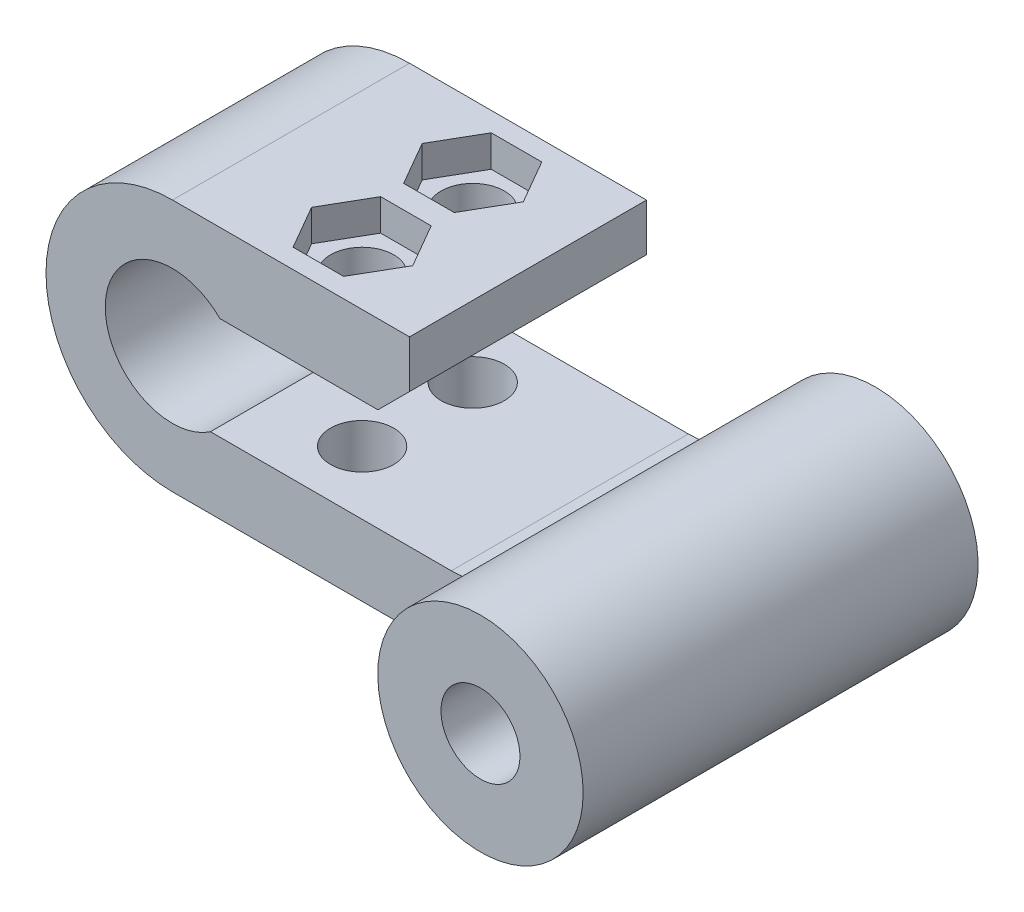
ISO-10303-21;
HEADER;
FILE_DESCRIPTION(('STEP AP214'),'2;1');
FILE_NAME('part.step','',(''),(''),'','','');
FILE_SCHEMA(('AUTOMOTIVE_DESIGN { 1 0 10303 214 1 1 1 1 }'));
ENDSEC;
DATA;
#1=APPLICATION_CONTEXT('core data for automotive mechanical design processes');
#2=APPLICATION_PROTOCOL_DEFINITION('international standard','automotive_design',2000,#1);
#3=PRODUCT_CONTEXT('',#1,'mechanical');
#4=PRODUCT('Part','Part','',(#3));
#5=PRODUCT_RELATED_PRODUCT_CATEGORY('part','',(#4));
#6=PRODUCT_DEFINITION_FORMATION('','',#4);
#7=PRODUCT_DEFINITION_CONTEXT('part definition',#1,'design');
#8=PRODUCT_DEFINITION('design','',#6,#7);
#9=PRODUCT_DEFINITION_SHAPE('','',#8);
#10=(LENGTH_UNIT() NAMED_UNIT(*) SI_UNIT(.MILLI.,.METRE.));
#11=(NAMED_UNIT(*) PLANE_ANGLE_UNIT() SI_UNIT($,.RADIAN.));
#12=(NAMED_UNIT(*) SI_UNIT($,.STERADIAN.) SOLID_ANGLE_UNIT());
#13=UNCERTAINTY_MEASURE_WITH_UNIT(LENGTH_MEASURE(1.E-05),#10,'distance_accuracy_value','');
#14=(GEOMETRIC_REPRESENTATION_CONTEXT(3) GLOBAL_UNCERTAINTY_ASSIGNED_CONTEXT((#13)) GLOBAL_UNIT_ASSIGNED_CONTEXT((#10,
#11,#12)) REPRESENTATION_CONTEXT('',''));
#15=CARTESIAN_POINT('',(0.,0.,0.));
#16=DIRECTION('',(0.,0.,1.));
#17=DIRECTION('',(1.,0.,0.));
#18=AXIS2_PLACEMENT_3D('',#15,#16,#17);
#19=CARTESIAN_POINT('',(6.17985722098058,-1.24574258897763,11.));
#20=DIRECTION('',(0.,1.,0.));
#21=DIRECTION('',(0.,0.,1.));
#22=AXIS2_PLACEMENT_3D('',#19,#20,#21);
#23=CYLINDRICAL_SURFACE('',#22,2.);
#24=CARTESIAN_POINT('',(6.17985722098058,9.75425064401288,11.));
#25=DIRECTION('',(0.,-1.,0.));
#26=DIRECTION('',(0.,0.,-1.));
#27=AXIS2_PLACEMENT_3D('',#24,#25,#26);
#28=CIRCLE('',#27,2.);
#29=CARTESIAN_POINT('',(6.17985722098058,9.75425064401288,9.));
#30=VERTEX_POINT('',#29);
#31=EDGE_CURVE('E299',#30,#30,#28,.T.);
#32=ORIENTED_EDGE('',*,*,#31,.T.);
#33=EDGE_LOOP('',(#32));
#34=FACE_BOUND('',#33,.T.);
#35=CARTESIAN_POINT('',(6.17985722098058,12.7542506440129,11.));
#36=DIRECTION('',(0.,1.,0.));
#37=DIRECTION('',(0.,0.,1.));
#38=AXIS2_PLACEMENT_3D('',#35,#36,#37);
#39=CIRCLE('',#38,2.);
#40=CARTESIAN_POINT('',(6.17985722098058,12.7542506440129,13.));
#41=VERTEX_POINT('',#40);
#42=EDGE_CURVE('E41',#41,#41,#39,.F.);
#43=ORIENTED_EDGE('',*,*,#42,.F.);
#44=EDGE_LOOP('',(#43));
#45=FACE_BOUND('',#44,.T.);
#46=ADVANCED_FACE('F36',(#34,#45),#23,.F.);
#47=CARTESIAN_POINT('',(6.17985722098058,-1.24574258897763,4.));
#48=DIRECTION('',(0.,1.,0.));
#49=DIRECTION('',(0.,0.,1.));
#50=AXIS2_PLACEMENT_3D('',#47,#48,#49);
#51=CYLINDRICAL_SURFACE('',#50,2.);
#52=CARTESIAN_POINT('',(6.17985722098058,9.75425064401288,4.));
#53=DIRECTION('',(0.,-1.,0.));
#54=DIRECTION('',(0.,0.,-1.));
#55=AXIS2_PLACEMENT_3D('',#52,#53,#54);
#56=CIRCLE('',#55,2.);
#57=CARTESIAN_POINT('',(6.17985722098058,9.75425064401288,2.));
#58=VERTEX_POINT('',#57);
#59=EDGE_CURVE('E308',#58,#58,#56,.T.);
#60=ORIENTED_EDGE('',*,*,#59,.T.);
#61=EDGE_LOOP('',(#60));
#62=FACE_BOUND('',#61,.T.);
#63=CARTESIAN_POINT('',(6.17985722098058,12.7542506440129,4.));
#64=DIRECTION('',(0.,1.,0.));
#65=DIRECTION('',(0.,0.,1.));
#66=AXIS2_PLACEMENT_3D('',#63,#64,#65);
#67=CIRCLE('',#66,2.);
#68=CARTESIAN_POINT('',(6.17985722098058,12.7542506440129,6.));
#69=VERTEX_POINT('',#68);
#70=EDGE_CURVE('E286',#69,#69,#67,.F.);
#71=ORIENTED_EDGE('',*,*,#70,.F.);
#72=EDGE_LOOP('',(#71));
#73=FACE_BOUND('',#72,.T.);
#74=ADVANCED_FACE('F409',(#62,#73),#51,.F.);
#75=CARTESIAN_POINT('',(0.,-1.24574258897763,15.));
#76=DIRECTION('',(0.,1.,0.));
#77=DIRECTION('',(-1.,0.,0.));
#78=AXIS2_PLACEMENT_3D('',#75,#76,#77);
#79=PLANE('',#78);
#80=CARTESIAN_POINT('',(6.17985722098058,-1.24574258897763,11.));
#81=DIRECTION('',(0.,1.,0.));
#82=DIRECTION('',(0.,0.,1.));
#83=AXIS2_PLACEMENT_3D('',#80,#81,#82);
#84=CIRCLE('',#83,2.);
#85=CARTESIAN_POINT('',(6.17985722098058,-1.24574258897763,13.));
#86=VERTEX_POINT('',#85);
#87=EDGE_CURVE('E296',#86,#86,#84,.T.);
#88=ORIENTED_EDGE('',*,*,#87,.T.);
#89=EDGE_LOOP('',(#88));
#90=FACE_BOUND('',#89,.T.);
#91=CARTESIAN_POINT('',(6.17985722098058,-1.24574258897763,4.));
#92=DIRECTION('',(0.,1.,0.));
#93=DIRECTION('',(0.,0.,1.));
#94=AXIS2_PLACEMENT_3D('',#91,#92,#93);
#95=CIRCLE('',#94,2.);
#96=CARTESIAN_POINT('',(6.17985722098058,-1.24574258897763,6.));
#97=VERTEX_POINT('',#96);
#98=EDGE_CURVE('E305',#97,#97,#95,.T.);
#99=ORIENTED_EDGE('',*,*,#98,.T.);
#100=EDGE_LOOP('',(#99));
#101=FACE_BOUND('',#100,.T.);
#102=DIRECTION('',(1.,0.,0.));
#103=VECTOR('',#102,1.);
#104=CARTESIAN_POINT('',(0.,-1.24574258897763,15.));
#105=LINE('',#104,#103);
#106=CARTESIAN_POINT('',(-1.83054816733695,-1.24574258897763,15.));
#107=VERTEX_POINT('',#106);
#108=CARTESIAN_POINT('',(20.7412486023875,-1.24574258897763,15.));
#109=VERTEX_POINT('',#108);
#110=EDGE_CURVE('E330',#107,#109,#105,.T.);
#111=ORIENTED_EDGE('',*,*,#110,.F.);
#112=DIRECTION('',(0.,0.,-1.));
#113=VECTOR('',#112,1.);
#114=CARTESIAN_POINT('',(-1.83054816733695,-1.24574258897763,15.));
#115=LINE('',#114,#113);
#116=CARTESIAN_POINT('',(-1.83054816733695,-1.24574258897763,0.));
#117=VERTEX_POINT('',#116);
#118=EDGE_CURVE('E369',#107,#117,#115,.T.);
#119=ORIENTED_EDGE('',*,*,#118,.T.);
#120=DIRECTION('',(1.,0.,0.));
#121=VECTOR('',#120,1.);
#122=CARTESIAN_POINT('',(0.,-1.24574258897763,0.));
#123=LINE('',#122,#121);
#124=CARTESIAN_POINT('',(27.6694518326631,-1.24574258897763,0.));
#125=VERTEX_POINT('',#124);
#126=EDGE_CURVE('E342',#117,#125,#123,.T.);
#127=ORIENTED_EDGE('',*,*,#126,.T.);
#128=DIRECTION('',(0.,0.,-1.));
#129=VECTOR('',#128,1.);
#130=CARTESIAN_POINT('',(27.6694518326631,-1.24574258897763,15.));
#131=LINE('',#130,#129);
#132=CARTESIAN_POINT('',(27.6694518326631,-1.24574258897763,18.));
#133=VERTEX_POINT('',#132);
#134=EDGE_CURVE('E383',#133,#125,#131,.T.);
#135=ORIENTED_EDGE('',*,*,#134,.F.);
#136=CARTESIAN_POINT('',(20.7412486023875,-1.24574258897763,15.));
#137=CARTESIAN_POINT('',(20.92770734225,-1.24574258897763,15.0000166059402));
#138=CARTESIAN_POINT('',(21.1139757104419,-1.24574258897763,15.0092390802562));
#139=CARTESIAN_POINT('',(21.4846324503399,-1.24574258897763,15.0440561219483));
#140=CARTESIAN_POINT('',(21.6690238103661,-1.24574258897763,15.0696182913552));
#141=CARTESIAN_POINT('',(22.0319788339475,-1.24574258897763,15.1345198161615));
#142=CARTESIAN_POINT('',(22.2105880436542,-1.24574258897763,15.173610987468));
#143=CARTESIAN_POINT('',(22.5647642054985,-1.24574258897763,15.2639248312056));
#144=CARTESIAN_POINT('',(22.7403296003568,-1.24574258897763,15.3151535276902));
#145=CARTESIAN_POINT('',(23.3424029276571,-1.24574258897763,15.5107529568727));
#146=CARTESIAN_POINT('',(23.7603133801105,-1.24574258897763,15.6817526098948));
#147=CARTESIAN_POINT('',(24.5757810278923,-1.24574258897763,16.0668290365426));
#148=CARTESIAN_POINT('',(24.9732945738818,-1.24574258897763,16.2809937239182));
#149=CARTESIAN_POINT('',(25.756250870451,-1.24574258897763,16.7379157384262));
#150=CARTESIAN_POINT('',(26.1415436898435,-1.24574258897763,16.9809245955478));
#151=CARTESIAN_POINT('',(26.9032756330931,-1.24574258897764,17.4795861286582));
#152=CARTESIAN_POINT('',(27.279720222547,-1.24574258897766,17.7352306796002));
#153=CARTESIAN_POINT('',(27.6605600203384,-1.24574258897763,17.9939592045208));
#154=CARTESIAN_POINT('',(27.6650059265361,-1.24574258897763,17.9969796030401));
#155=CARTESIAN_POINT('',(27.6694518326631,-1.24574258897763,18.));
#156=B_SPLINE_CURVE_WITH_KNOTS('',3,(#136,#137,#138,#139,#140,#141,#142,#143,#144,#145,#146,
#147,#148,#149,#150,#151,#152,#153,#154,#155),.UNSPECIFIED.,.F.,.F.,(4,2,2,2,2,2,2,2,2,4),(0.,
0.558875296934062,1.11664589172157,1.66468382868809,2.21299433780129,3.56338228703728,
4.91654886561008,6.28252795583859,7.64763983552954,7.66376435102622),.UNSPECIFIED.);
#157=EDGE_CURVE('E46',#133,#109,#156,.F.);
#158=ORIENTED_EDGE('',*,*,#157,.T.);
#159=EDGE_LOOP('',(#111,#119,#127,#135,#158));
#160=FACE_BOUND('',#159,.T.);
#161=ADVANCED_FACE('F403',(#90,#101,#160),#79,.F.);
#162=CARTESIAN_POINT('',(0.,3.25425064401287,15.));
#163=DIRECTION('',(0.,-1.,0.));
#164=DIRECTION('',(1.,0.,0.));
#165=AXIS2_PLACEMENT_3D('',#162,#163,#164);
#166=PLANE('',#165);
#167=CARTESIAN_POINT('',(6.17985722098058,3.25425064401288,11.));
#168=DIRECTION('',(0.,-1.,0.));
#169=DIRECTION('',(1.,0.,0.));
#170=AXIS2_PLACEMENT_3D('',#167,#168,#169);
#171=CIRCLE('',#170,2.);
#172=CARTESIAN_POINT('',(8.17985722098059,3.25425064401288,11.));
#173=VERTEX_POINT('',#172);
#174=EDGE_CURVE('E302',#173,#173,#171,.T.);
#175=ORIENTED_EDGE('',*,*,#174,.T.);
#176=EDGE_LOOP('',(#175));
#177=FACE_BOUND('',#176,.T.);
#178=CARTESIAN_POINT('',(6.17985722098058,3.25425064401288,4.));
#179=DIRECTION('',(0.,-1.,0.));
#180=DIRECTION('',(1.,0.,0.));
#181=AXIS2_PLACEMENT_3D('',#178,#179,#180);
#182=CIRCLE('',#181,2.);
#183=CARTESIAN_POINT('',(8.17985722098059,3.25425064401288,4.));
#184=VERTEX_POINT('',#183);
#185=EDGE_CURVE('E311',#184,#184,#182,.T.);
#186=ORIENTED_EDGE('',*,*,#185,.T.);
#187=EDGE_LOOP('',(#186));
#188=FACE_BOUND('',#187,.T.);
#189=DIRECTION('',(-1.,0.,0.));
#190=VECTOR('',#189,1.);
#191=CARTESIAN_POINT('',(0.,3.25425064401287,15.));
#192=LINE('',#191,#190);
#193=CARTESIAN_POINT('',(15.8267302647113,3.25425064401288,15.));
#194=VERTEX_POINT('',#193);
#195=CARTESIAN_POINT('',(0.580354698995034,3.25425064401287,15.));
#196=VERTEX_POINT('',#195);
#197=EDGE_CURVE('E316',#194,#196,#192,.T.);
#198=ORIENTED_EDGE('',*,*,#197,.F.);
#199=DIRECTION('',(0.,0.,1.));
#200=VECTOR('',#199,1.);
#201=CARTESIAN_POINT('',(15.8267302647113,3.25425064401288,0.));
#202=LINE('',#201,#200);
#203=CARTESIAN_POINT('',(15.8267302647113,3.25425064401288,0.));
#204=VERTEX_POINT('',#203);
#205=EDGE_CURVE('E385',#194,#204,#202,.F.);
#206=ORIENTED_EDGE('',*,*,#205,.T.);
#207=DIRECTION('',(-1.,0.,0.));
#208=VECTOR('',#207,1.);
#209=CARTESIAN_POINT('',(0.,3.25425064401287,0.));
#210=LINE('',#209,#208);
#211=CARTESIAN_POINT('',(0.580354698995032,3.25425064401287,0.));
#212=VERTEX_POINT('',#211);
#213=EDGE_CURVE('E348',#204,#212,#210,.T.);
#214=ORIENTED_EDGE('',*,*,#213,.T.);
#215=DIRECTION('',(0.,0.,-1.));
#216=VECTOR('',#215,1.);
#217=CARTESIAN_POINT('',(0.580354698995032,3.25425064401287,15.));
#218=LINE('',#217,#216);
#219=EDGE_CURVE('E381',#196,#212,#218,.T.);
#220=ORIENTED_EDGE('',*,*,#219,.F.);
#221=EDGE_LOOP('',(#198,#206,#214,#220));
#222=FACE_BOUND('',#221,.T.);
#223=ADVANCED_FACE('F408',(#177,#188,#222),#166,.F.);
#224=CARTESIAN_POINT('',(-1.83054816733695,6.75425741102237,15.));
#225=DIRECTION('',(0.,0.,-1.));
#226=DIRECTION('',(-1.,0.,0.));
#227=AXIS2_PLACEMENT_3D('',#224,#225,#226);
#228=CYLINDRICAL_SURFACE('',#227,4.25);
#229=DIRECTION('',(0.,0.,-1.));
#230=VECTOR('',#229,1.);
#231=CARTESIAN_POINT('',(1.17985722098058,9.75425064401288,15.));
#232=LINE('',#231,#230);
#233=CARTESIAN_POINT('',(1.17985722098058,9.75425064401288,15.));
#234=VERTEX_POINT('',#233);
#235=CARTESIAN_POINT('',(1.17985722098058,9.75425064401288,0.));
#236=VERTEX_POINT('',#235);
#237=EDGE_CURVE('E379',#234,#236,#232,.T.);
#238=ORIENTED_EDGE('',*,*,#237,.F.);
#239=CARTESIAN_POINT('',(-1.83054816733695,6.75425741102237,15.));
#240=DIRECTION('',(0.,0.,1.));
#241=DIRECTION('',(1.,0.,0.));
#242=AXIS2_PLACEMENT_3D('',#239,#240,#241);
#243=CIRCLE('',#242,4.25);
#244=EDGE_CURVE('E318',#196,#234,#243,.F.);
#245=ORIENTED_EDGE('',*,*,#244,.F.);
#246=ORIENTED_EDGE('',*,*,#219,.T.);
#247=CARTESIAN_POINT('',(-1.83054816733695,6.75425741102237,0.));
#248=DIRECTION('',(0.,0.,1.));
#249=DIRECTION('',(1.,0.,0.));
#250=AXIS2_PLACEMENT_3D('',#247,#248,#249);
#251=CIRCLE('',#250,4.25);
#252=EDGE_CURVE('E351',#236,#212,#251,.T.);
#253=ORIENTED_EDGE('',*,*,#252,.F.);
#254=EDGE_LOOP('',(#238,#245,#246,#253));
#255=FACE_BOUND('',#254,.T.);
#256=ADVANCED_FACE('F460',(#255),#228,.F.);
#257=CARTESIAN_POINT('',(0.,9.75425064401288,15.));
#258=DIRECTION('',(0.,-1.,0.));
#259=DIRECTION('',(0.,0.,-1.));
#260=AXIS2_PLACEMENT_3D('',#257,#258,#259);
#261=PLANE('',#260);
#262=ORIENTED_EDGE('',*,*,#31,.F.);
#263=EDGE_LOOP('',(#262));
#264=FACE_BOUND('',#263,.T.);
#265=ORIENTED_EDGE('',*,*,#59,.F.);
#266=EDGE_LOOP('',(#265));
#267=FACE_BOUND('',#266,.T.);
#268=DIRECTION('',(0.,0.,-1.));
#269=VECTOR('',#268,1.);
#270=CARTESIAN_POINT('',(11.1798572209806,9.75425064401288,15.));
#271=LINE('',#270,#269);
#272=CARTESIAN_POINT('',(11.1798572209806,9.75425064401288,15.));
#273=VERTEX_POINT('',#272);
#274=CARTESIAN_POINT('',(11.1798572209806,9.75425064401288,0.));
#275=VERTEX_POINT('',#274);
#276=EDGE_CURVE('E377',#273,#275,#271,.T.);
#277=ORIENTED_EDGE('',*,*,#276,.F.);
#278=DIRECTION('',(1.,0.,0.));
#279=VECTOR('',#278,1.);
#280=CARTESIAN_POINT('',(0.,9.75425064401288,15.));
#281=LINE('',#280,#279);
#282=EDGE_CURVE('E320',#234,#273,#281,.T.);
#283=ORIENTED_EDGE('',*,*,#282,.F.);
#284=ORIENTED_EDGE('',*,*,#237,.T.);
#285=DIRECTION('',(-1.,0.,0.));
#286=VECTOR('',#285,1.);
#287=CARTESIAN_POINT('',(0.,9.75425064401288,0.));
#288=LINE('',#287,#286);
#289=EDGE_CURVE('E354',#275,#236,#288,.T.);
#290=ORIENTED_EDGE('',*,*,#289,.F.);
#291=EDGE_LOOP('',(#277,#283,#284,#290));
#292=FACE_BOUND('',#291,.T.);
#293=ADVANCED_FACE('F484',(#264,#267,#292),#261,.T.);
#294=CARTESIAN_POINT('',(0.712803288483824,-0.712803288483827,15.));
#295=DIRECTION('',(0.707106781186546,-0.707106781186549,0.));
#296=DIRECTION('',(0.707106781186549,0.707106781186546,0.));
#297=AXIS2_PLACEMENT_3D('',#294,#295,#296);
#298=PLANE('',#297);
#299=DIRECTION('',(0.,0.,-1.));
#300=VECTOR('',#299,1.);
#301=CARTESIAN_POINT('',(13.1798572209806,11.7542506440129,15.));
#302=LINE('',#301,#300);
#303=CARTESIAN_POINT('',(13.1798572209806,11.7542506440129,15.));
#304=VERTEX_POINT('',#303);
#305=CARTESIAN_POINT('',(13.1798572209806,11.7542506440129,0.));
#306=VERTEX_POINT('',#305);
#307=EDGE_CURVE('E375',#304,#306,#302,.T.);
#308=ORIENTED_EDGE('',*,*,#307,.F.);
#309=DIRECTION('',(0.707106781186549,0.707106781186546,0.));
#310=VECTOR('',#309,1.);
#311=CARTESIAN_POINT('',(0.712803288483824,-0.712803288483827,15.));
#312=LINE('',#311,#310);
#313=EDGE_CURVE('E322',#273,#304,#312,.T.);
#314=ORIENTED_EDGE('',*,*,#313,.F.);
#315=ORIENTED_EDGE('',*,*,#276,.T.);
#316=DIRECTION('',(-0.707106781186549,-0.707106781186546,0.));
#317=VECTOR('',#316,1.);
#318=CARTESIAN_POINT('',(0.712803288483824,-0.712803288483827,0.));
#319=LINE('',#318,#317);
#320=EDGE_CURVE('E357',#306,#275,#319,.T.);
#321=ORIENTED_EDGE('',*,*,#320,.F.);
#322=EDGE_LOOP('',(#308,#314,#315,#321));
#323=FACE_BOUND('',#322,.T.);
#324=ADVANCED_FACE('F488',(#323),#298,.T.);
#325=CARTESIAN_POINT('',(13.1798572209806,0.,15.));
#326=DIRECTION('',(1.,0.,0.));
#327=DIRECTION('',(0.,0.,-1.));
#328=AXIS2_PLACEMENT_3D('',#325,#326,#327);
#329=PLANE('',#328);
#330=DIRECTION('',(0.,0.,-1.));
#331=VECTOR('',#330,1.);
#332=CARTESIAN_POINT('',(13.1798572209806,14.7542506440129,15.));
#333=LINE('',#332,#331);
#334=CARTESIAN_POINT('',(13.1798572209806,14.7542506440129,15.));
#335=VERTEX_POINT('',#334);
#336=CARTESIAN_POINT('',(13.1798572209806,14.7542506440129,0.));
#337=VERTEX_POINT('',#336);
#338=EDGE_CURVE('E373',#335,#337,#333,.T.);
#339=ORIENTED_EDGE('',*,*,#338,.F.);
#340=DIRECTION('',(0.,1.,0.));
#341=VECTOR('',#340,1.);
#342=CARTESIAN_POINT('',(13.1798572209806,0.,15.));
#343=LINE('',#342,#341);
#344=EDGE_CURVE('E324',#304,#335,#343,.T.);
#345=ORIENTED_EDGE('',*,*,#344,.F.);
#346=ORIENTED_EDGE('',*,*,#307,.T.);
#347=DIRECTION('',(0.,-1.,0.));
#348=VECTOR('',#347,1.);
#349=CARTESIAN_POINT('',(13.1798572209806,0.,0.));
#350=LINE('',#349,#348);
#351=EDGE_CURVE('E360',#337,#306,#350,.T.);
#352=ORIENTED_EDGE('',*,*,#351,.F.);
#353=EDGE_LOOP('',(#339,#345,#346,#352));
#354=FACE_BOUND('',#353,.T.);
#355=ADVANCED_FACE('F493',(#354),#329,.T.);
#356=CARTESIAN_POINT('',(0.,14.7542506440129,15.));
#357=DIRECTION('',(0.,1.,0.));
#358=DIRECTION('',(0.,0.,1.));
#359=AXIS2_PLACEMENT_3D('',#356,#357,#358);
#360=PLANE('',#359);
#361=DIRECTION('',(0.5,0.,-0.866025403784439));
#362=VECTOR('',#361,1.);
#363=CARTESIAN_POINT('',(7.77985722098058,14.7542506440129,13.7712812921102));
#364=LINE('',#363,#362);
#365=CARTESIAN_POINT('',(7.77985722098058,14.7542506440129,13.7712812921102));
#366=VERTEX_POINT('',#365);
#367=CARTESIAN_POINT('',(9.37985722098058,14.7542506440129,11.));
#368=VERTEX_POINT('',#367);
#369=EDGE_CURVE('E54',#366,#368,#364,.T.);
#370=ORIENTED_EDGE('',*,*,#369,.F.);
#371=DIRECTION('',(1.,0.,0.));
#372=VECTOR('',#371,1.);
#373=CARTESIAN_POINT('',(4.57985722098059,14.7542506440129,13.7712812921102));
#374=LINE('',#373,#372);
#375=CARTESIAN_POINT('',(4.57985722098059,14.7542506440129,13.7712812921102));
#376=VERTEX_POINT('',#375);
#377=EDGE_CURVE('E216',#376,#366,#374,.T.);
#378=ORIENTED_EDGE('',*,*,#377,.F.);
#379=DIRECTION('',(0.5,0.,0.866025403784439));
#380=VECTOR('',#379,1.);
#381=CARTESIAN_POINT('',(2.97985722098059,14.7542506440129,11.));
#382=LINE('',#381,#380);
#383=CARTESIAN_POINT('',(2.97985722098059,14.7542506440129,11.));
#384=VERTEX_POINT('',#383);
#385=EDGE_CURVE('E219',#384,#376,#382,.T.);
#386=ORIENTED_EDGE('',*,*,#385,.F.);
#387=DIRECTION('',(-0.5,0.,0.866025403784439));
#388=VECTOR('',#387,1.);
#389=CARTESIAN_POINT('',(4.57985722098058,14.7542506440129,8.2287187078898));
#390=LINE('',#389,#388);
#391=CARTESIAN_POINT('',(4.57985722098058,14.7542506440129,8.2287187078898));
#392=VERTEX_POINT('',#391);
#393=EDGE_CURVE('E235',#392,#384,#390,.T.);
#394=ORIENTED_EDGE('',*,*,#393,.F.);
#395=DIRECTION('',(-1.,0.,0.));
#396=VECTOR('',#395,1.);
#397=CARTESIAN_POINT('',(7.77985722098058,14.7542506440129,8.2287187078898));
#398=LINE('',#397,#396);
#399=CARTESIAN_POINT('',(7.77985722098058,14.7542506440129,8.2287187078898));
#400=VERTEX_POINT('',#399);
#401=EDGE_CURVE('E232',#400,#392,#398,.T.);
#402=ORIENTED_EDGE('',*,*,#401,.F.);
#403=DIRECTION('',(-0.5,0.,-0.866025403784439));
#404=VECTOR('',#403,1.);
#405=CARTESIAN_POINT('',(9.37985722098058,14.7542506440129,11.));
#406=LINE('',#405,#404);
#407=EDGE_CURVE('E230',#368,#400,#406,.T.);
#408=ORIENTED_EDGE('',*,*,#407,.F.);
#409=EDGE_LOOP('',(#370,#378,#386,#394,#402,#408));
#410=FACE_BOUND('',#409,.T.);
#411=DIRECTION('',(0.5,0.,-0.866025403784439));
#412=VECTOR('',#411,1.);
#413=CARTESIAN_POINT('',(7.77985722098058,14.7542506440129,6.77128129211021));
#414=LINE('',#413,#412);
#415=CARTESIAN_POINT('',(7.77985722098058,14.7542506440129,6.77128129211021));
#416=VERTEX_POINT('',#415);
#417=CARTESIAN_POINT('',(9.37985722098059,14.7542506440129,4.));
#418=VERTEX_POINT('',#417);
#419=EDGE_CURVE('E62',#416,#418,#414,.T.);
#420=ORIENTED_EDGE('',*,*,#419,.F.);
#421=DIRECTION('',(1.,0.,0.));
#422=VECTOR('',#421,1.);
#423=CARTESIAN_POINT('',(4.57985722098058,14.7542506440129,6.77128129211021));
#424=LINE('',#423,#422);
#425=CARTESIAN_POINT('',(4.57985722098058,14.7542506440129,6.77128129211021));
#426=VERTEX_POINT('',#425);
#427=EDGE_CURVE('E253',#426,#416,#424,.T.);
#428=ORIENTED_EDGE('',*,*,#427,.F.);
#429=DIRECTION('',(0.5,0.,0.866025403784439));
#430=VECTOR('',#429,1.);
#431=CARTESIAN_POINT('',(2.97985722098058,14.7542506440129,4.));
#432=LINE('',#431,#430);
#433=CARTESIAN_POINT('',(2.97985722098058,14.7542506440129,4.));
#434=VERTEX_POINT('',#433);
#435=EDGE_CURVE('E279',#434,#426,#432,.T.);
#436=ORIENTED_EDGE('',*,*,#435,.F.);
#437=DIRECTION('',(-0.5,0.,0.866025403784439));
#438=VECTOR('',#437,1.);
#439=CARTESIAN_POINT('',(4.57985722098058,14.7542506440129,1.22871870788979));
#440=LINE('',#439,#438);
#441=CARTESIAN_POINT('',(4.57985722098058,14.7542506440129,1.22871870788979));
#442=VERTEX_POINT('',#441);
#443=EDGE_CURVE('E276',#442,#434,#440,.T.);
#444=ORIENTED_EDGE('',*,*,#443,.F.);
#445=DIRECTION('',(-1.,0.,0.));
#446=VECTOR('',#445,1.);
#447=CARTESIAN_POINT('',(7.77985722098058,14.7542506440129,1.22871870788979));
#448=LINE('',#447,#446);
#449=CARTESIAN_POINT('',(7.77985722098058,14.7542506440129,1.22871870788979));
#450=VERTEX_POINT('',#449);
#451=EDGE_CURVE('E273',#450,#442,#448,.T.);
#452=ORIENTED_EDGE('',*,*,#451,.F.);
#453=DIRECTION('',(-0.5,0.,-0.866025403784439));
#454=VECTOR('',#453,1.);
#455=CARTESIAN_POINT('',(9.37985722098058,14.7542506440129,4.));
#456=LINE('',#455,#454);
#457=EDGE_CURVE('E270',#418,#450,#456,.T.);
#458=ORIENTED_EDGE('',*,*,#457,.F.);
#459=EDGE_LOOP('',(#420,#428,#436,#444,#452,#458));
#460=FACE_BOUND('',#459,.T.);
#461=DIRECTION('',(0.,0.,-1.));
#462=VECTOR('',#461,1.);
#463=CARTESIAN_POINT('',(-1.82014277901941,14.7542506440129,15.));
#464=LINE('',#463,#462);
#465=CARTESIAN_POINT('',(-1.82014277901941,14.7542506440129,15.));
#466=VERTEX_POINT('',#465);
#467=CARTESIAN_POINT('',(-1.82014277901941,14.7542506440129,0.));
#468=VERTEX_POINT('',#467);
#469=EDGE_CURVE('E371',#466,#468,#464,.T.);
#470=ORIENTED_EDGE('',*,*,#469,.F.);
#471=DIRECTION('',(-1.,0.,0.));
#472=VECTOR('',#471,1.);
#473=CARTESIAN_POINT('',(0.,14.7542506440129,15.));
#474=LINE('',#473,#472);
#475=EDGE_CURVE('E326',#335,#466,#474,.T.);
#476=ORIENTED_EDGE('',*,*,#475,.F.);
#477=ORIENTED_EDGE('',*,*,#338,.T.);
#478=DIRECTION('',(1.,0.,0.));
#479=VECTOR('',#478,1.);
#480=CARTESIAN_POINT('',(0.,14.7542506440129,0.));
#481=LINE('',#480,#479);
#482=EDGE_CURVE('E363',#468,#337,#481,.T.);
#483=ORIENTED_EDGE('',*,*,#482,.F.);
#484=EDGE_LOOP('',(#470,#476,#477,#483));
#485=FACE_BOUND('',#484,.T.);
#486=ADVANCED_FACE('F498',(#410,#460,#485),#360,.T.);
#487=CARTESIAN_POINT('',(-1.83054816733695,6.75425741102237,15.));
#488=DIRECTION('',(0.,0.,-1.));
#489=DIRECTION('',(-1.,0.,0.));
#490=AXIS2_PLACEMENT_3D('',#487,#488,#489);
#491=CYLINDRICAL_SURFACE('',#490,8.);
#492=CARTESIAN_POINT('',(-1.83054816733695,6.75425741102237,15.));
#493=DIRECTION('',(0.,0.,1.));
#494=DIRECTION('',(1.,0.,0.));
#495=AXIS2_PLACEMENT_3D('',#492,#493,#494);
#496=CIRCLE('',#495,8.);
#497=EDGE_CURVE('E328',#466,#107,#496,.T.);
#498=ORIENTED_EDGE('',*,*,#497,.F.);
#499=ORIENTED_EDGE('',*,*,#469,.T.);
#500=CARTESIAN_POINT('',(-1.83054816733695,6.75425741102237,0.));
#501=DIRECTION('',(0.,0.,1.));
#502=DIRECTION('',(1.,0.,0.));
#503=AXIS2_PLACEMENT_3D('',#500,#501,#502);
#504=CIRCLE('',#503,8.);
#505=EDGE_CURVE('E366',#468,#117,#504,.T.);
#506=ORIENTED_EDGE('',*,*,#505,.T.);
#507=ORIENTED_EDGE('',*,*,#118,.F.);
#508=EDGE_LOOP('',(#498,#499,#506,#507));
#509=FACE_BOUND('',#508,.T.);
#510=ADVANCED_FACE('F427',(#509),#491,.T.);
#511=CARTESIAN_POINT('',(0.,0.,25.));
#512=DIRECTION('',(0.,0.,1.));
#513=DIRECTION('',(1.,0.,0.));
#514=AXIS2_PLACEMENT_3D('',#511,#512,#513);
#515=PLANE('',#514);
#516=CARTESIAN_POINT('',(27.6694518326631,5.25425741102237,25.));
#517=DIRECTION('',(0.,0.,1.));
#518=DIRECTION('',(1.,0.,0.));
#519=AXIS2_PLACEMENT_3D('',#516,#517,#518);
#520=CIRCLE('',#519,2.5);
#521=CARTESIAN_POINT('',(30.1694518326631,5.25425741102237,25.));
#522=VERTEX_POINT('',#521);
#523=EDGE_CURVE('E333',#522,#522,#520,.T.);
#524=ORIENTED_EDGE('',*,*,#523,.F.);
#525=EDGE_LOOP('',(#524));
#526=FACE_BOUND('',#525,.T.);
#527=CARTESIAN_POINT('',(27.6694518326631,5.25425741102237,25.));
#528=DIRECTION('',(0.,0.,1.));
#529=DIRECTION('',(1.,0.,0.));
#530=AXIS2_PLACEMENT_3D('',#527,#528,#529);
#531=CIRCLE('',#530,6.5);
#532=CARTESIAN_POINT('',(34.1694518326631,5.25425741102237,25.));
#533=VERTEX_POINT('',#532);
#534=EDGE_CURVE('E336',#533,#533,#531,.T.);
#535=ORIENTED_EDGE('',*,*,#534,.T.);
#536=EDGE_LOOP('',(#535));
#537=FACE_BOUND('',#536,.T.);
#538=ADVANCED_FACE('F420',(#526,#537),#515,.T.);
#539=CARTESIAN_POINT('',(15.8267302647113,9.25425064401288,15.));
#540=DIRECTION('',(0.,0.,-1.));
#541=DIRECTION('',(-1.,0.,0.));
#542=AXIS2_PLACEMENT_3D('',#539,#540,#541);
#543=CYLINDRICAL_SURFACE('',#542,6.);
#544=CARTESIAN_POINT('',(15.8267302647113,9.25425064401288,15.));
#545=DIRECTION('',(0.,0.,1.));
#546=DIRECTION('',(1.,0.,0.));
#547=AXIS2_PLACEMENT_3D('',#544,#545,#546);
#548=CIRCLE('',#547,6.);
#549=CARTESIAN_POINT('',(18.2844297125939,3.78070394887293,15.));
#550=VERTEX_POINT('',#549);
#551=EDGE_CURVE('E314',#550,#194,#548,.F.);
#552=ORIENTED_EDGE('',*,*,#551,.F.);
#553=CARTESIAN_POINT('',(18.2844297125939,3.78070394887293,15.));
#554=CARTESIAN_POINT('',(18.3696640462424,3.81895291347259,14.9999790596979));
#555=CARTESIAN_POINT('',(18.4539450006303,3.85920954888873,15.0040601951146));
#556=CARTESIAN_POINT('',(18.6198516296836,3.94322071478237,15.0198860348313));
#557=CARTESIAN_POINT('',(18.7014811782602,3.98696978621143,15.0316189766923));
#558=CARTESIAN_POINT('',(18.8606250408765,4.07701586657384,15.06202444041));
#559=CARTESIAN_POINT('',(18.9381774091614,4.12327528224833,15.0806105594364));
#560=CARTESIAN_POINT('',(19.0898655723118,4.21838290859679,15.1241389668394));
#561=CARTESIAN_POINT('',(19.1639997718066,4.26723230568349,15.1490841884546));
#562=CARTESIAN_POINT('',(19.3280456495437,4.38052278684904,15.2121979812004));
#563=CARTESIAN_POINT('',(19.4168308815514,4.44562050960281,15.2521185201694));
#564=CARTESIAN_POINT('',(19.5882796658439,4.57851247930572,15.3399488272102));
#565=CARTESIAN_POINT('',(19.6709385408968,4.64630872699765,15.3878646104196));
#566=CARTESIAN_POINT('',(19.8305201424638,4.78425638155853,15.4907421843948));
#567=CARTESIAN_POINT('',(19.9074115800018,4.85441800716696,15.5457385485165));
#568=CARTESIAN_POINT('',(20.055170392264,4.9962255291615,15.6614850064614));
#569=CARTESIAN_POINT('',(20.1260391380326,5.06787108309285,15.7222337840746));
#570=CARTESIAN_POINT('',(20.3051104434588,5.25795795211078,15.8885018189479));
#571=CARTESIAN_POINT('',(20.4085871990115,5.37734542514132,15.998042859772));
#572=CARTESIAN_POINT('',(20.6019098624371,5.61810938558039,16.226585464675));
#573=CARTESIAN_POINT('',(20.6917455030756,5.73948729574204,16.3455940530167));
#574=CARTESIAN_POINT('',(20.8592326237194,5.98379878503921,16.5903926659417));
#575=CARTESIAN_POINT('',(20.9368811946217,6.10673272806119,16.716184300067));
#576=CARTESIAN_POINT('',(21.0812129994578,6.35409388273191,16.9723414847916));
#577=CARTESIAN_POINT('',(21.1479002793389,6.47852052512833,17.1027053260763));
#578=CARTESIAN_POINT('',(21.2680030466903,6.72245001129002,17.3591610081865));
#579=CARTESIAN_POINT('',(21.3219410435876,6.84185550092716,17.4851029224994));
#580=CARTESIAN_POINT('',(21.4214637712007,7.08263708478053,17.7380928868171));
#581=CARTESIAN_POINT('',(21.4670585439949,7.2040106160069,17.8651394116727));
#582=CARTESIAN_POINT('',(21.5095333042948,7.32921645522517,17.9947856484329));
#583=CARTESIAN_POINT('',(21.5103857970343,7.33173489577874,17.9973928285372));
#584=CARTESIAN_POINT('',(21.5112366173281,7.33425389217743,18.));
#585=B_SPLINE_CURVE_WITH_KNOTS('',3,(#553,#554,#555,#556,#557,#558,#559,#560,#561,#562,#563,
#564,#565,#566,#567,#568,#569,#570,#571,#572,#573,#574,#575,#576,#577,#578,#579,#580,#581,#582,
#583,#584),.UNSPECIFIED.,.F.,.F.,(4,2,2,2,2,2,2,2,2,2,2,2,2,2,2,4),(0.,0.280083485310526,
0.559737434910414,0.835979853112762,1.11234992387342,1.46313414593545,1.81418347664671,
2.16701700346691,2.51976999262055,3.09555801606276,3.67177729132909,4.24813390397213,
4.82427729622665,5.36928114223432,5.91362463236834,5.92479602566152),.UNSPECIFIED.);
#586=CARTESIAN_POINT('',(21.5112366173281,7.33425389217743,18.));
#587=VERTEX_POINT('',#586);
#588=EDGE_CURVE('E11',#550,#587,#585,.T.);
#589=ORIENTED_EDGE('',*,*,#588,.T.);
#590=DIRECTION('',(0.,0.,-1.));
#591=VECTOR('',#590,1.);
#592=CARTESIAN_POINT('',(21.5112366173281,7.33425389217743,15.));
#593=LINE('',#592,#591);
#594=CARTESIAN_POINT('',(21.5112366173281,7.33425389217743,0.));
#595=VERTEX_POINT('',#594);
#596=EDGE_CURVE('E387',#595,#587,#593,.F.);
#597=ORIENTED_EDGE('',*,*,#596,.F.);
#598=CARTESIAN_POINT('',(15.8267302647113,9.25425064401288,0.));
#599=DIRECTION('',(0.,0.,1.));
#600=DIRECTION('',(1.,0.,0.));
#601=AXIS2_PLACEMENT_3D('',#598,#599,#600);
#602=CIRCLE('',#601,6.);
#603=EDGE_CURVE('E389',#204,#595,#602,.T.);
#604=ORIENTED_EDGE('',*,*,#603,.F.);
#605=ORIENTED_EDGE('',*,*,#205,.F.);
#606=EDGE_LOOP('',(#552,#589,#597,#604,#605));
#607=FACE_BOUND('',#606,.T.);
#608=ADVANCED_FACE('F417',(#607),#543,.F.);
#609=CARTESIAN_POINT('',(27.6694518326631,5.25425741102237,15.));
#610=DIRECTION('',(0.,0.,-1.));
#611=DIRECTION('',(-1.,0.,0.));
#612=AXIS2_PLACEMENT_3D('',#609,#610,#611);
#613=CYLINDRICAL_SURFACE('',#612,6.5);
#614=CARTESIAN_POINT('',(27.6694518326631,5.25425741102237,18.));
#615=DIRECTION('',(0.,0.,1.));
#616=DIRECTION('',(1.,0.,0.));
#617=AXIS2_PLACEMENT_3D('',#614,#615,#616);
#618=CIRCLE('',#617,6.5);
#619=EDGE_CURVE('E391',#587,#133,#618,.T.);
#620=ORIENTED_EDGE('',*,*,#619,.T.);
#621=ORIENTED_EDGE('',*,*,#134,.T.);
#622=CARTESIAN_POINT('',(27.6694518326631,5.25425741102237,0.));
#623=DIRECTION('',(0.,0.,1.));
#624=DIRECTION('',(1.,0.,0.));
#625=AXIS2_PLACEMENT_3D('',#622,#623,#624);
#626=CIRCLE('',#625,6.5);
#627=EDGE_CURVE('E345',#125,#595,#626,.T.);
#628=ORIENTED_EDGE('',*,*,#627,.T.);
#629=ORIENTED_EDGE('',*,*,#596,.T.);
#630=EDGE_LOOP('',(#620,#621,#628,#629));
#631=FACE_BOUND('',#630,.T.);
#632=ORIENTED_EDGE('',*,*,#534,.F.);
#633=EDGE_LOOP('',(#632));
#634=FACE_BOUND('',#633,.T.);
#635=ADVANCED_FACE('F411',(#631,#634),#613,.T.);
#636=CARTESIAN_POINT('',(27.6694518326631,5.25425741102237,15.));
#637=DIRECTION('',(0.,0.,-1.));
#638=DIRECTION('',(-1.,0.,0.));
#639=AXIS2_PLACEMENT_3D('',#636,#637,#638);
#640=CYLINDRICAL_SURFACE('',#639,2.5);
#641=CARTESIAN_POINT('',(27.6694518326631,5.25425741102237,0.));
#642=DIRECTION('',(0.,0.,1.));
#643=DIRECTION('',(1.,0.,0.));
#644=AXIS2_PLACEMENT_3D('',#641,#642,#643);
#645=CIRCLE('',#644,2.5);
#646=CARTESIAN_POINT('',(30.1694518326631,5.25425741102237,0.));
#647=VERTEX_POINT('',#646);
#648=EDGE_CURVE('E339',#647,#647,#645,.T.);
#649=ORIENTED_EDGE('',*,*,#648,.F.);
#650=EDGE_LOOP('',(#649));
#651=FACE_BOUND('',#650,.T.);
#652=ORIENTED_EDGE('',*,*,#523,.T.);
#653=EDGE_LOOP('',(#652));
#654=FACE_BOUND('',#653,.T.);
#655=ADVANCED_FACE('F413',(#651,#654),#640,.F.);
#656=CARTESIAN_POINT('',(0.,0.,0.));
#657=DIRECTION('',(0.,0.,1.));
#658=DIRECTION('',(1.,0.,0.));
#659=AXIS2_PLACEMENT_3D('',#656,#657,#658);
#660=PLANE('',#659);
#661=ORIENTED_EDGE('',*,*,#648,.T.);
#662=EDGE_LOOP('',(#661));
#663=FACE_BOUND('',#662,.T.);
#664=ORIENTED_EDGE('',*,*,#126,.F.);
#665=ORIENTED_EDGE('',*,*,#505,.F.);
#666=ORIENTED_EDGE('',*,*,#482,.T.);
#667=ORIENTED_EDGE('',*,*,#351,.T.);
#668=ORIENTED_EDGE('',*,*,#320,.T.);
#669=ORIENTED_EDGE('',*,*,#289,.T.);
#670=ORIENTED_EDGE('',*,*,#252,.T.);
#671=ORIENTED_EDGE('',*,*,#213,.F.);
#672=ORIENTED_EDGE('',*,*,#603,.T.);
#673=ORIENTED_EDGE('',*,*,#627,.F.);
#674=EDGE_LOOP('',(#664,#665,#666,#667,#668,#669,#670,#671,#672,#673));
#675=FACE_BOUND('',#674,.T.);
#676=ADVANCED_FACE('F415',(#663,#675),#660,.F.);
#677=CARTESIAN_POINT('',(0.,0.,15.));
#678=DIRECTION('',(0.,0.,1.));
#679=DIRECTION('',(1.,0.,0.));
#680=AXIS2_PLACEMENT_3D('',#677,#678,#679);
#681=PLANE('',#680);
#682=ORIENTED_EDGE('',*,*,#110,.T.);
#683=CARTESIAN_POINT('',(27.6694518326631,5.25425741102237,15.));
#684=DIRECTION('',(0.,0.,1.));
#685=DIRECTION('',(1.,0.,0.));
#686=AXIS2_PLACEMENT_3D('',#683,#684,#685);
#687=CIRCLE('',#686,9.5);
#688=EDGE_CURVE('E394',#109,#550,#687,.F.);
#689=ORIENTED_EDGE('',*,*,#688,.T.);
#690=ORIENTED_EDGE('',*,*,#551,.T.);
#691=ORIENTED_EDGE('',*,*,#197,.T.);
#692=ORIENTED_EDGE('',*,*,#244,.T.);
#693=ORIENTED_EDGE('',*,*,#282,.T.);
#694=ORIENTED_EDGE('',*,*,#313,.T.);
#695=ORIENTED_EDGE('',*,*,#344,.T.);
#696=ORIENTED_EDGE('',*,*,#475,.T.);
#697=ORIENTED_EDGE('',*,*,#497,.T.);
#698=EDGE_LOOP('',(#682,#689,#690,#691,#692,#693,#694,#695,#696,#697));
#699=FACE_BOUND('',#698,.T.);
#700=ADVANCED_FACE('F480',(#699),#681,.T.);
#701=CARTESIAN_POINT('',(27.6694518326631,5.25425741102237,18.));
#702=DIRECTION('',(0.,0.,1.));
#703=DIRECTION('',(1.,0.,0.));
#704=AXIS2_PLACEMENT_3D('',#701,#702,#703);
#705=TOROIDAL_SURFACE('',#704,9.5,3.);
#706=ORIENTED_EDGE('',*,*,#588,.F.);
#707=ORIENTED_EDGE('',*,*,#688,.F.);
#708=ORIENTED_EDGE('',*,*,#157,.F.);
#709=ORIENTED_EDGE('',*,*,#619,.F.);
#710=EDGE_LOOP('',(#706,#707,#708,#709));
#711=FACE_BOUND('',#710,.T.);
#712=ADVANCED_FACE('F38',(#711),#705,.F.);
#713=ORIENTED_EDGE('',*,*,#98,.F.);
#714=EDGE_LOOP('',(#713));
#715=FACE_BOUND('',#714,.T.);
#716=ORIENTED_EDGE('',*,*,#185,.F.);
#717=EDGE_LOOP('',(#716));
#718=FACE_BOUND('',#717,.T.);
#719=ADVANCED_FACE('F440',(#715,#718),#51,.F.);
#720=ORIENTED_EDGE('',*,*,#87,.F.);
#721=EDGE_LOOP('',(#720));
#722=FACE_BOUND('',#721,.T.);
#723=ORIENTED_EDGE('',*,*,#174,.F.);
#724=EDGE_LOOP('',(#723));
#725=FACE_BOUND('',#724,.T.);
#726=ADVANCED_FACE('F434',(#722,#725),#23,.F.);
#727=CARTESIAN_POINT('',(0.,12.7542506440129,0.));
#728=DIRECTION('',(0.,1.,0.));
#729=DIRECTION('',(0.,0.,1.));
#730=AXIS2_PLACEMENT_3D('',#727,#728,#729);
#731=PLANE('',#730);
#732=DIRECTION('',(0.5,0.,-0.866025403784439));
#733=VECTOR('',#732,1.);
#734=CARTESIAN_POINT('',(7.77985722098058,12.7542506440129,6.77128129211021));
#735=LINE('',#734,#733);
#736=CARTESIAN_POINT('',(7.77985722098058,12.7542506440129,6.77128129211021));
#737=VERTEX_POINT('',#736);
#738=CARTESIAN_POINT('',(9.37985722098058,12.7542506440129,4.));
#739=VERTEX_POINT('',#738);
#740=EDGE_CURVE('E249',#737,#739,#735,.T.);
#741=ORIENTED_EDGE('',*,*,#740,.T.);
#742=DIRECTION('',(-0.5,0.,-0.866025403784439));
#743=VECTOR('',#742,1.);
#744=CARTESIAN_POINT('',(9.37985722098058,12.7542506440129,4.));
#745=LINE('',#744,#743);
#746=CARTESIAN_POINT('',(7.77985722098058,12.7542506440129,1.22871870788979));
#747=VERTEX_POINT('',#746);
#748=EDGE_CURVE('E252',#739,#747,#745,.T.);
#749=ORIENTED_EDGE('',*,*,#748,.T.);
#750=DIRECTION('',(-1.,0.,0.));
#751=VECTOR('',#750,1.);
#752=CARTESIAN_POINT('',(7.77985722098058,12.7542506440129,1.22871870788979));
#753=LINE('',#752,#751);
#754=CARTESIAN_POINT('',(4.57985722098058,12.7542506440129,1.22871870788979));
#755=VERTEX_POINT('',#754);
#756=EDGE_CURVE('E256',#747,#755,#753,.T.);
#757=ORIENTED_EDGE('',*,*,#756,.T.);
#758=DIRECTION('',(-0.5,0.,0.866025403784439));
#759=VECTOR('',#758,1.);
#760=CARTESIAN_POINT('',(4.57985722098058,12.7542506440129,1.22871870788979));
#761=LINE('',#760,#759);
#762=CARTESIAN_POINT('',(2.97985722098058,12.7542506440129,4.));
#763=VERTEX_POINT('',#762);
#764=EDGE_CURVE('E259',#755,#763,#761,.T.);
#765=ORIENTED_EDGE('',*,*,#764,.T.);
#766=DIRECTION('',(0.5,0.,0.866025403784439));
#767=VECTOR('',#766,1.);
#768=CARTESIAN_POINT('',(2.97985722098058,12.7542506440129,4.));
#769=LINE('',#768,#767);
#770=CARTESIAN_POINT('',(4.57985722098058,12.7542506440129,6.77128129211021));
#771=VERTEX_POINT('',#770);
#772=EDGE_CURVE('E262',#763,#771,#769,.T.);
#773=ORIENTED_EDGE('',*,*,#772,.T.);
#774=DIRECTION('',(1.,0.,0.));
#775=VECTOR('',#774,1.);
#776=CARTESIAN_POINT('',(4.57985722098058,12.7542506440129,6.77128129211021));
#777=LINE('',#776,#775);
#778=EDGE_CURVE('E265',#771,#737,#777,.T.);
#779=ORIENTED_EDGE('',*,*,#778,.T.);
#780=EDGE_LOOP('',(#741,#749,#757,#765,#773,#779));
#781=FACE_BOUND('',#780,.T.);
#782=ORIENTED_EDGE('',*,*,#70,.T.);
#783=EDGE_LOOP('',(#782));
#784=FACE_BOUND('',#783,.T.);
#785=ADVANCED_FACE('F444',(#781,#784),#731,.T.);
#786=CARTESIAN_POINT('',(7.77985722098058,12.7542506440129,6.77128129211021));
#787=DIRECTION('',(0.866025403784439,0.,0.5));
#788=DIRECTION('',(0.5,0.,-0.866025403784439));
#789=AXIS2_PLACEMENT_3D('',#786,#787,#788);
#790=PLANE('',#789);
#791=ORIENTED_EDGE('',*,*,#419,.T.);
#792=DIRECTION('',(0.,1.,0.));
#793=VECTOR('',#792,1.);
#794=CARTESIAN_POINT('',(9.37985722098058,12.7542506440129,4.));
#795=LINE('',#794,#793);
#796=EDGE_CURVE('E268',#739,#418,#795,.T.);
#797=ORIENTED_EDGE('',*,*,#796,.F.);
#798=ORIENTED_EDGE('',*,*,#740,.F.);
#799=DIRECTION('',(0.,1.,0.));
#800=VECTOR('',#799,1.);
#801=CARTESIAN_POINT('',(7.77985722098058,12.7542506440129,6.77128129211021));
#802=LINE('',#801,#800);
#803=EDGE_CURVE('E284',#737,#416,#802,.T.);
#804=ORIENTED_EDGE('',*,*,#803,.T.);
#805=EDGE_LOOP('',(#791,#797,#798,#804));
#806=FACE_BOUND('',#805,.T.);
#807=ADVANCED_FACE('F450',(#806),#790,.F.);
#808=CARTESIAN_POINT('',(4.57985722098058,12.7542506440129,6.77128129211021));
#809=DIRECTION('',(0.,0.,1.));
#810=DIRECTION('',(1.,0.,0.));
#811=AXIS2_PLACEMENT_3D('',#808,#809,#810);
#812=PLANE('',#811);
#813=ORIENTED_EDGE('',*,*,#427,.T.);
#814=ORIENTED_EDGE('',*,*,#803,.F.);
#815=ORIENTED_EDGE('',*,*,#778,.F.);
#816=DIRECTION('',(0.,1.,0.));
#817=VECTOR('',#816,1.);
#818=CARTESIAN_POINT('',(4.57985722098058,12.7542506440129,6.77128129211021));
#819=LINE('',#818,#817);
#820=EDGE_CURVE('E287',#771,#426,#819,.T.);
#821=ORIENTED_EDGE('',*,*,#820,.T.);
#822=EDGE_LOOP('',(#813,#814,#815,#821));
#823=FACE_BOUND('',#822,.T.);
#824=ADVANCED_FACE('F666',(#823),#812,.F.);
#825=CARTESIAN_POINT('',(2.97985722098058,12.7542506440129,4.));
#826=DIRECTION('',(-0.866025403784439,0.,0.5));
#827=DIRECTION('',(0.5,0.,0.866025403784439));
#828=AXIS2_PLACEMENT_3D('',#825,#826,#827);
#829=PLANE('',#828);
#830=ORIENTED_EDGE('',*,*,#435,.T.);
#831=ORIENTED_EDGE('',*,*,#820,.F.);
#832=ORIENTED_EDGE('',*,*,#772,.F.);
#833=DIRECTION('',(0.,1.,0.));
#834=VECTOR('',#833,1.);
#835=CARTESIAN_POINT('',(2.97985722098058,12.7542506440129,4.));
#836=LINE('',#835,#834);
#837=EDGE_CURVE('E289',#763,#434,#836,.T.);
#838=ORIENTED_EDGE('',*,*,#837,.T.);
#839=EDGE_LOOP('',(#830,#831,#832,#838));
#840=FACE_BOUND('',#839,.T.);
#841=ADVANCED_FACE('F673',(#840),#829,.F.);
#842=CARTESIAN_POINT('',(4.57985722098058,12.7542506440129,1.22871870788979));
#843=DIRECTION('',(-0.866025403784439,0.,-0.5));
#844=DIRECTION('',(-0.5,0.,0.866025403784439));
#845=AXIS2_PLACEMENT_3D('',#842,#843,#844);
#846=PLANE('',#845);
#847=ORIENTED_EDGE('',*,*,#443,.T.);
#848=ORIENTED_EDGE('',*,*,#837,.F.);
#849=ORIENTED_EDGE('',*,*,#764,.F.);
#850=DIRECTION('',(0.,1.,0.));
#851=VECTOR('',#850,1.);
#852=CARTESIAN_POINT('',(4.57985722098058,12.7542506440129,1.22871870788979));
#853=LINE('',#852,#851);
#854=EDGE_CURVE('E291',#755,#442,#853,.T.);
#855=ORIENTED_EDGE('',*,*,#854,.T.);
#856=EDGE_LOOP('',(#847,#848,#849,#855));
#857=FACE_BOUND('',#856,.T.);
#858=ADVANCED_FACE('F682',(#857),#846,.F.);
#859=CARTESIAN_POINT('',(7.77985722098058,12.7542506440129,1.22871870788979));
#860=DIRECTION('',(0.,0.,-1.));
#861=DIRECTION('',(-1.,0.,0.));
#862=AXIS2_PLACEMENT_3D('',#859,#860,#861);
#863=PLANE('',#862);
#864=ORIENTED_EDGE('',*,*,#451,.T.);
#865=ORIENTED_EDGE('',*,*,#854,.F.);
#866=ORIENTED_EDGE('',*,*,#756,.F.);
#867=DIRECTION('',(0.,1.,0.));
#868=VECTOR('',#867,1.);
#869=CARTESIAN_POINT('',(7.77985722098058,12.7542506440129,1.22871870788979));
#870=LINE('',#869,#868);
#871=EDGE_CURVE('E293',#747,#450,#870,.T.);
#872=ORIENTED_EDGE('',*,*,#871,.T.);
#873=EDGE_LOOP('',(#864,#865,#866,#872));
#874=FACE_BOUND('',#873,.T.);
#875=ADVANCED_FACE('F691',(#874),#863,.F.);
#876=CARTESIAN_POINT('',(9.37985722098058,12.7542506440129,4.));
#877=DIRECTION('',(0.866025403784439,0.,-0.5));
#878=DIRECTION('',(-0.5,0.,-0.866025403784439));
#879=AXIS2_PLACEMENT_3D('',#876,#877,#878);
#880=PLANE('',#879);
#881=ORIENTED_EDGE('',*,*,#457,.T.);
#882=ORIENTED_EDGE('',*,*,#871,.F.);
#883=ORIENTED_EDGE('',*,*,#748,.F.);
#884=ORIENTED_EDGE('',*,*,#796,.T.);
#885=EDGE_LOOP('',(#881,#882,#883,#884));
#886=FACE_BOUND('',#885,.T.);
#887=ADVANCED_FACE('F700',(#886),#880,.F.);
#888=CARTESIAN_POINT('',(0.,12.7542506440129,0.));
#889=DIRECTION('',(0.,1.,0.));
#890=DIRECTION('',(0.,0.,1.));
#891=AXIS2_PLACEMENT_3D('',#888,#889,#890);
#892=PLANE('',#891);
#893=DIRECTION('',(0.5,0.,-0.866025403784439));
#894=VECTOR('',#893,1.);
#895=CARTESIAN_POINT('',(7.77985722098058,12.7542506440129,13.7712812921102));
#896=LINE('',#895,#894);
#897=CARTESIAN_POINT('',(7.77985722098058,12.7542506440129,13.7712812921102));
#898=VERTEX_POINT('',#897);
#899=CARTESIAN_POINT('',(9.37985722098058,12.7542506440129,11.));
#900=VERTEX_POINT('',#899);
#901=EDGE_CURVE('E196',#898,#900,#896,.T.);
#902=ORIENTED_EDGE('',*,*,#901,.T.);
#903=DIRECTION('',(-0.5,0.,-0.866025403784439));
#904=VECTOR('',#903,1.);
#905=CARTESIAN_POINT('',(9.37985722098058,12.7542506440129,11.));
#906=LINE('',#905,#904);
#907=CARTESIAN_POINT('',(7.77985722098058,12.7542506440129,8.2287187078898));
#908=VERTEX_POINT('',#907);
#909=EDGE_CURVE('E205',#900,#908,#906,.T.);
#910=ORIENTED_EDGE('',*,*,#909,.T.);
#911=DIRECTION('',(-1.,0.,0.));
#912=VECTOR('',#911,1.);
#913=CARTESIAN_POINT('',(7.77985722098058,12.7542506440129,8.2287187078898));
#914=LINE('',#913,#912);
#915=CARTESIAN_POINT('',(4.57985722098058,12.7542506440129,8.2287187078898));
#916=VERTEX_POINT('',#915);
#917=EDGE_CURVE('E210',#908,#916,#914,.T.);
#918=ORIENTED_EDGE('',*,*,#917,.T.);
#919=DIRECTION('',(-0.5,0.,0.866025403784439));
#920=VECTOR('',#919,1.);
#921=CARTESIAN_POINT('',(4.57985722098058,12.7542506440129,8.2287187078898));
#922=LINE('',#921,#920);
#923=CARTESIAN_POINT('',(2.97985722098059,12.7542506440129,11.));
#924=VERTEX_POINT('',#923);
#925=EDGE_CURVE('E223',#916,#924,#922,.T.);
#926=ORIENTED_EDGE('',*,*,#925,.T.);
#927=DIRECTION('',(0.5,0.,0.866025403784439));
#928=VECTOR('',#927,1.);
#929=CARTESIAN_POINT('',(2.97985722098059,12.7542506440129,11.));
#930=LINE('',#929,#928);
#931=CARTESIAN_POINT('',(4.57985722098059,12.7542506440129,13.7712812921102));
#932=VERTEX_POINT('',#931);
#933=EDGE_CURVE('E226',#924,#932,#930,.T.);
#934=ORIENTED_EDGE('',*,*,#933,.T.);
#935=DIRECTION('',(1.,0.,0.));
#936=VECTOR('',#935,1.);
#937=CARTESIAN_POINT('',(4.57985722098059,12.7542506440129,13.7712812921102));
#938=LINE('',#937,#936);
#939=EDGE_CURVE('E202',#932,#898,#938,.T.);
#940=ORIENTED_EDGE('',*,*,#939,.T.);
#941=EDGE_LOOP('',(#902,#910,#918,#926,#934,#940));
#942=FACE_BOUND('',#941,.T.);
#943=ORIENTED_EDGE('',*,*,#42,.T.);
#944=EDGE_LOOP('',(#943));
#945=FACE_BOUND('',#944,.T.);
#946=ADVANCED_FACE('F212',(#942,#945),#892,.T.);
#947=CARTESIAN_POINT('',(7.77985722098058,12.7542506440129,13.7712812921102));
#948=DIRECTION('',(0.866025403784439,0.,0.5));
#949=DIRECTION('',(0.5,0.,-0.866025403784439));
#950=AXIS2_PLACEMENT_3D('',#947,#948,#949);
#951=PLANE('',#950);
#952=ORIENTED_EDGE('',*,*,#369,.T.);
#953=DIRECTION('',(0.,1.,0.));
#954=VECTOR('',#953,1.);
#955=CARTESIAN_POINT('',(9.37985722098058,12.7542506440129,11.));
#956=LINE('',#955,#954);
#957=EDGE_CURVE('E192',#900,#368,#956,.T.);
#958=ORIENTED_EDGE('',*,*,#957,.F.);
#959=ORIENTED_EDGE('',*,*,#901,.F.);
#960=DIRECTION('',(0.,1.,0.));
#961=VECTOR('',#960,1.);
#962=CARTESIAN_POINT('',(7.77985722098058,12.7542506440129,13.7712812921102));
#963=LINE('',#962,#961);
#964=EDGE_CURVE('E240',#898,#366,#963,.T.);
#965=ORIENTED_EDGE('',*,*,#964,.T.);
#966=EDGE_LOOP('',(#952,#958,#959,#965));
#967=FACE_BOUND('',#966,.T.);
#968=ADVANCED_FACE('F194',(#967),#951,.F.);
#969=CARTESIAN_POINT('',(4.57985722098059,12.7542506440129,13.7712812921102));
#970=DIRECTION('',(0.,0.,1.));
#971=DIRECTION('',(1.,0.,0.));
#972=AXIS2_PLACEMENT_3D('',#969,#970,#971);
#973=PLANE('',#972);
#974=ORIENTED_EDGE('',*,*,#377,.T.);
#975=ORIENTED_EDGE('',*,*,#964,.F.);
#976=ORIENTED_EDGE('',*,*,#939,.F.);
#977=DIRECTION('',(0.,1.,0.));
#978=VECTOR('',#977,1.);
#979=CARTESIAN_POINT('',(4.57985722098059,12.7542506440129,13.7712812921102));
#980=LINE('',#979,#978);
#981=EDGE_CURVE('E242',#932,#376,#980,.T.);
#982=ORIENTED_EDGE('',*,*,#981,.T.);
#983=EDGE_LOOP('',(#974,#975,#976,#982));
#984=FACE_BOUND('',#983,.T.);
#985=ADVANCED_FACE('F724',(#984),#973,.F.);
#986=CARTESIAN_POINT('',(2.97985722098059,12.7542506440129,11.));
#987=DIRECTION('',(-0.866025403784439,0.,0.5));
#988=DIRECTION('',(0.5,0.,0.866025403784439));
#989=AXIS2_PLACEMENT_3D('',#986,#987,#988);
#990=PLANE('',#989);
#991=ORIENTED_EDGE('',*,*,#385,.T.);
#992=ORIENTED_EDGE('',*,*,#981,.F.);
#993=ORIENTED_EDGE('',*,*,#933,.F.);
#994=DIRECTION('',(0.,1.,0.));
#995=VECTOR('',#994,1.);
#996=CARTESIAN_POINT('',(2.97985722098059,12.7542506440129,11.));
#997=LINE('',#996,#995);
#998=EDGE_CURVE('E244',#924,#384,#997,.T.);
#999=ORIENTED_EDGE('',*,*,#998,.T.);
#1000=EDGE_LOOP('',(#991,#992,#993,#999));
#1001=FACE_BOUND('',#1000,.T.);
#1002=ADVANCED_FACE('F732',(#1001),#990,.F.);
#1003=CARTESIAN_POINT('',(4.57985722098058,12.7542506440129,8.2287187078898));
#1004=DIRECTION('',(-0.866025403784439,0.,-0.5));
#1005=DIRECTION('',(-0.5,0.,0.866025403784439));
#1006=AXIS2_PLACEMENT_3D('',#1003,#1004,#1005);
#1007=PLANE('',#1006);
#1008=ORIENTED_EDGE('',*,*,#393,.T.);
#1009=ORIENTED_EDGE('',*,*,#998,.F.);
#1010=ORIENTED_EDGE('',*,*,#925,.F.);
#1011=DIRECTION('',(0.,1.,0.));
#1012=VECTOR('',#1011,1.);
#1013=CARTESIAN_POINT('',(4.57985722098058,12.7542506440129,8.2287187078898));
#1014=LINE('',#1013,#1012);
#1015=EDGE_CURVE('E246',#916,#392,#1014,.T.);
#1016=ORIENTED_EDGE('',*,*,#1015,.T.);
#1017=EDGE_LOOP('',(#1008,#1009,#1010,#1016));
#1018=FACE_BOUND('',#1017,.T.);
#1019=ADVANCED_FACE('F741',(#1018),#1007,.F.);
#1020=CARTESIAN_POINT('',(7.77985722098058,12.7542506440129,8.2287187078898));
#1021=DIRECTION('',(0.,0.,-1.));
#1022=DIRECTION('',(-1.,0.,0.));
#1023=AXIS2_PLACEMENT_3D('',#1020,#1021,#1022);
#1024=PLANE('',#1023);
#1025=ORIENTED_EDGE('',*,*,#401,.T.);
#1026=ORIENTED_EDGE('',*,*,#1015,.F.);
#1027=ORIENTED_EDGE('',*,*,#917,.F.);
#1028=DIRECTION('',(0.,1.,0.));
#1029=VECTOR('',#1028,1.);
#1030=CARTESIAN_POINT('',(7.77985722098058,12.7542506440129,8.2287187078898));
#1031=LINE('',#1030,#1029);
#1032=EDGE_CURVE('E201',#908,#400,#1031,.T.);
#1033=ORIENTED_EDGE('',*,*,#1032,.T.);
#1034=EDGE_LOOP('',(#1025,#1026,#1027,#1033));
#1035=FACE_BOUND('',#1034,.T.);
#1036=ADVANCED_FACE('F750',(#1035),#1024,.F.);
#1037=CARTESIAN_POINT('',(9.37985722098058,12.7542506440129,11.));
#1038=DIRECTION('',(0.866025403784439,0.,-0.5));
#1039=DIRECTION('',(-0.5,0.,-0.866025403784439));
#1040=AXIS2_PLACEMENT_3D('',#1037,#1038,#1039);
#1041=PLANE('',#1040);
#1042=ORIENTED_EDGE('',*,*,#407,.T.);
#1043=ORIENTED_EDGE('',*,*,#1032,.F.);
#1044=ORIENTED_EDGE('',*,*,#909,.F.);
#1045=ORIENTED_EDGE('',*,*,#957,.T.);
#1046=EDGE_LOOP('',(#1042,#1043,#1044,#1045));
#1047=FACE_BOUND('',#1046,.T.);
#1048=ADVANCED_FACE('F206',(#1047),#1041,.F.);
#1049=CLOSED_SHELL('',(#46,#74,#161,#223,#256,#293,#324,#355,#486,#510,#538,#608,#635,#655,#676,
#700,#712,#719,#726,#785,#807,#824,#841,#858,#875,#887,#946,#968,#985,#1002,#1019,#1036,#1048));
#1050=MANIFOLD_SOLID_BREP('B2',#1049);
#1051=ADVANCED_BREP_SHAPE_REPRESENTATION('',(#18,#1050),#14);
#1052=SHAPE_DEFINITION_REPRESENTATION(#9,#1051);
ENDSEC;
END-ISO-10303-21;
